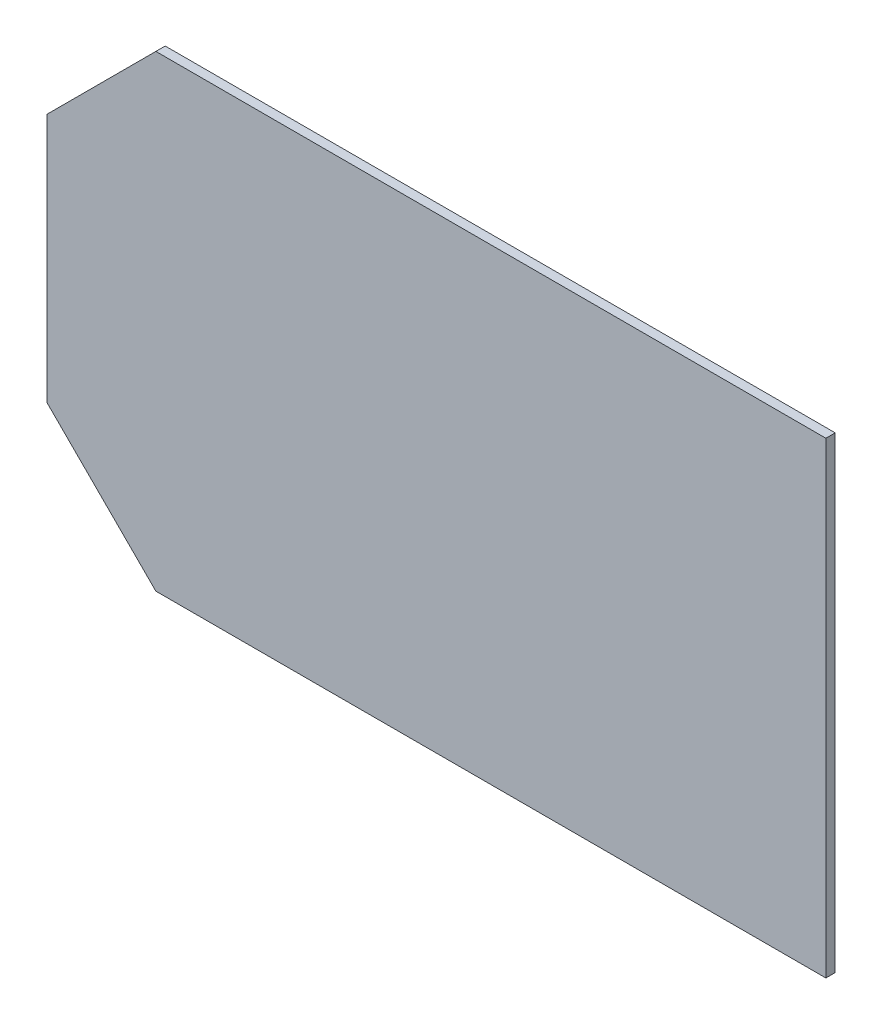
ISO-10303-21;
HEADER;
FILE_DESCRIPTION(('STEP AP214'),'2;1');
FILE_NAME('part.step','',(''),(''),'','','');
FILE_SCHEMA(('AUTOMOTIVE_DESIGN { 1 0 10303 214 1 1 1 1 }'));
ENDSEC;
DATA;
#1=APPLICATION_CONTEXT('core data for automotive mechanical design processes');
#2=APPLICATION_PROTOCOL_DEFINITION('international standard','automotive_design',2000,#1);
#3=PRODUCT_CONTEXT('',#1,'mechanical');
#4=PRODUCT('Part','Part','',(#3));
#5=PRODUCT_RELATED_PRODUCT_CATEGORY('part','',(#4));
#6=PRODUCT_DEFINITION_FORMATION('','',#4);
#7=PRODUCT_DEFINITION_CONTEXT('part definition',#1,'design');
#8=PRODUCT_DEFINITION('design','',#6,#7);
#9=PRODUCT_DEFINITION_SHAPE('','',#8);
#10=(LENGTH_UNIT() NAMED_UNIT(*) SI_UNIT(.MILLI.,.METRE.));
#11=(NAMED_UNIT(*) PLANE_ANGLE_UNIT() SI_UNIT($,.RADIAN.));
#12=(NAMED_UNIT(*) SI_UNIT($,.STERADIAN.) SOLID_ANGLE_UNIT());
#13=UNCERTAINTY_MEASURE_WITH_UNIT(LENGTH_MEASURE(1.E-05),#10,'distance_accuracy_value','');
#14=(GEOMETRIC_REPRESENTATION_CONTEXT(3) GLOBAL_UNCERTAINTY_ASSIGNED_CONTEXT((#13)) GLOBAL_UNIT_ASSIGNED_CONTEXT((#10,
#11,#12)) REPRESENTATION_CONTEXT('',''));
#15=CARTESIAN_POINT('',(0.,0.,0.));
#16=DIRECTION('',(0.,0.,1.));
#17=DIRECTION('',(1.,0.,0.));
#18=AXIS2_PLACEMENT_3D('',#15,#16,#17);
#19=CARTESIAN_POINT('',(125.,75.,3.));
#20=DIRECTION('',(-1.,0.,0.));
#21=DIRECTION('',(0.,-1.,0.));
#22=AXIS2_PLACEMENT_3D('',#19,#20,#21);
#23=PLANE('',#22);
#24=DIRECTION('',(0.,1.,0.));
#25=VECTOR('',#24,1.);
#26=CARTESIAN_POINT('',(125.,75.,0.));
#27=LINE('',#26,#25);
#28=CARTESIAN_POINT('',(125.,-75.,0.));
#29=VERTEX_POINT('',#28);
#30=CARTESIAN_POINT('',(125.,75.,0.));
#31=VERTEX_POINT('',#30);
#32=EDGE_CURVE('E122',#29,#31,#27,.T.);
#33=ORIENTED_EDGE('',*,*,#32,.T.);
#34=DIRECTION('',(0.,0.,-1.));
#35=VECTOR('',#34,1.);
#36=CARTESIAN_POINT('',(125.,75.,3.));
#37=LINE('',#36,#35);
#38=CARTESIAN_POINT('',(125.,75.,3.));
#39=VERTEX_POINT('',#38);
#40=EDGE_CURVE('E103',#39,#31,#37,.T.);
#41=ORIENTED_EDGE('',*,*,#40,.F.);
#42=DIRECTION('',(0.,1.,0.));
#43=VECTOR('',#42,1.);
#44=CARTESIAN_POINT('',(125.,75.,3.));
#45=LINE('',#44,#43);
#46=CARTESIAN_POINT('',(125.,-75.,3.));
#47=VERTEX_POINT('',#46);
#48=EDGE_CURVE('E109',#47,#39,#45,.T.);
#49=ORIENTED_EDGE('',*,*,#48,.F.);
#50=DIRECTION('',(0.,0.,-1.));
#51=VECTOR('',#50,1.);
#52=CARTESIAN_POINT('',(125.,-75.,3.));
#53=LINE('',#52,#51);
#54=EDGE_CURVE('E125',#47,#29,#53,.T.);
#55=ORIENTED_EDGE('',*,*,#54,.T.);
#56=EDGE_LOOP('',(#33,#41,#49,#55));
#57=FACE_BOUND('',#56,.T.);
#58=ADVANCED_FACE('F45',(#57),#23,.F.);
#59=CARTESIAN_POINT('',(-125.,75.,3.));
#60=DIRECTION('',(0.,-1.,0.));
#61=DIRECTION('',(0.,0.,-1.));
#62=AXIS2_PLACEMENT_3D('',#59,#60,#61);
#63=PLANE('',#62);
#64=DIRECTION('',(-1.,0.,0.));
#65=VECTOR('',#64,1.);
#66=CARTESIAN_POINT('',(-125.,75.,0.));
#67=LINE('',#66,#65);
#68=CARTESIAN_POINT('',(-89.9999999999999,75.,0.));
#69=VERTEX_POINT('',#68);
#70=EDGE_CURVE('E165',#31,#69,#67,.T.);
#71=ORIENTED_EDGE('',*,*,#70,.T.);
#72=DIRECTION('',(0.,0.,1.));
#73=VECTOR('',#72,1.);
#74=CARTESIAN_POINT('',(-89.9999999999999,75.,3.));
#75=LINE('',#74,#73);
#76=CARTESIAN_POINT('',(-89.9999999999999,75.,3.));
#77=VERTEX_POINT('',#76);
#78=EDGE_CURVE('E11',#69,#77,#75,.T.);
#79=ORIENTED_EDGE('',*,*,#78,.T.);
#80=DIRECTION('',(-1.,0.,0.));
#81=VECTOR('',#80,1.);
#82=CARTESIAN_POINT('',(-125.,75.,3.));
#83=LINE('',#82,#81);
#84=EDGE_CURVE('E99',#39,#77,#83,.T.);
#85=ORIENTED_EDGE('',*,*,#84,.F.);
#86=ORIENTED_EDGE('',*,*,#40,.T.);
#87=EDGE_LOOP('',(#71,#79,#85,#86));
#88=FACE_BOUND('',#87,.T.);
#89=ADVANCED_FACE('F101',(#88),#63,.F.);
#90=CARTESIAN_POINT('',(-125.,75.,3.));
#91=DIRECTION('',(1.,0.,0.));
#92=DIRECTION('',(0.,0.,-1.));
#93=AXIS2_PLACEMENT_3D('',#90,#91,#92);
#94=PLANE('',#93);
#95=DIRECTION('',(0.,-1.,0.));
#96=VECTOR('',#95,1.);
#97=CARTESIAN_POINT('',(-125.,75.,0.));
#98=LINE('',#97,#96);
#99=CARTESIAN_POINT('',(-125.,40.,0.));
#100=VERTEX_POINT('',#99);
#101=CARTESIAN_POINT('',(-125.,-39.9999999999998,0.));
#102=VERTEX_POINT('',#101);
#103=EDGE_CURVE('E161',#100,#102,#98,.T.);
#104=ORIENTED_EDGE('',*,*,#103,.T.);
#105=DIRECTION('',(0.,0.,1.));
#106=VECTOR('',#105,1.);
#107=CARTESIAN_POINT('',(-125.,-39.9999999999998,3.));
#108=LINE('',#107,#106);
#109=CARTESIAN_POINT('',(-125.,-39.9999999999998,3.));
#110=VERTEX_POINT('',#109);
#111=EDGE_CURVE('E68',#102,#110,#108,.T.);
#112=ORIENTED_EDGE('',*,*,#111,.T.);
#113=DIRECTION('',(0.,-1.,0.));
#114=VECTOR('',#113,1.);
#115=CARTESIAN_POINT('',(-125.,75.,3.));
#116=LINE('',#115,#114);
#117=CARTESIAN_POINT('',(-125.,40.,3.));
#118=VERTEX_POINT('',#117);
#119=EDGE_CURVE('E108',#118,#110,#116,.T.);
#120=ORIENTED_EDGE('',*,*,#119,.F.);
#121=DIRECTION('',(0.,0.,-1.));
#122=VECTOR('',#121,1.);
#123=CARTESIAN_POINT('',(-125.,40.,3.));
#124=LINE('',#123,#122);
#125=EDGE_CURVE('E140',#118,#100,#124,.T.);
#126=ORIENTED_EDGE('',*,*,#125,.T.);
#127=EDGE_LOOP('',(#104,#112,#120,#126));
#128=FACE_BOUND('',#127,.T.);
#129=ADVANCED_FACE('F162',(#128),#94,.F.);
#130=CARTESIAN_POINT('',(-125.,-75.,3.));
#131=DIRECTION('',(0.,1.,0.));
#132=DIRECTION('',(0.,0.,1.));
#133=AXIS2_PLACEMENT_3D('',#130,#131,#132);
#134=PLANE('',#133);
#135=DIRECTION('',(1.,0.,0.));
#136=VECTOR('',#135,1.);
#137=CARTESIAN_POINT('',(-125.,-75.,3.));
#138=LINE('',#137,#136);
#139=CARTESIAN_POINT('',(-90.,-75.,3.));
#140=VERTEX_POINT('',#139);
#141=EDGE_CURVE('E114',#140,#47,#138,.T.);
#142=ORIENTED_EDGE('',*,*,#141,.F.);
#143=DIRECTION('',(0.,0.,-1.));
#144=VECTOR('',#143,1.);
#145=CARTESIAN_POINT('',(-90.,-75.,3.));
#146=LINE('',#145,#144);
#147=CARTESIAN_POINT('',(-90.,-75.,0.));
#148=VERTEX_POINT('',#147);
#149=EDGE_CURVE('E124',#140,#148,#146,.T.);
#150=ORIENTED_EDGE('',*,*,#149,.T.);
#151=DIRECTION('',(1.,0.,0.));
#152=VECTOR('',#151,1.);
#153=CARTESIAN_POINT('',(-125.,-75.,0.));
#154=LINE('',#153,#152);
#155=EDGE_CURVE('E119',#148,#29,#154,.T.);
#156=ORIENTED_EDGE('',*,*,#155,.T.);
#157=ORIENTED_EDGE('',*,*,#54,.F.);
#158=EDGE_LOOP('',(#142,#150,#156,#157));
#159=FACE_BOUND('',#158,.T.);
#160=ADVANCED_FACE('F153',(#159),#134,.F.);
#161=CARTESIAN_POINT('',(0.,0.,3.));
#162=DIRECTION('',(0.,0.,1.));
#163=DIRECTION('',(1.,0.,0.));
#164=AXIS2_PLACEMENT_3D('',#161,#162,#163);
#165=PLANE('',#164);
#166=ORIENTED_EDGE('',*,*,#119,.T.);
#167=DIRECTION('',(-0.707106781186546,0.707106781186549,0.));
#168=VECTOR('',#167,1.);
#169=CARTESIAN_POINT('',(-82.5000000000002,-82.4999999999998,3.));
#170=LINE('',#169,#168);
#171=EDGE_CURVE('E55',#110,#140,#170,.F.);
#172=ORIENTED_EDGE('',*,*,#171,.T.);
#173=ORIENTED_EDGE('',*,*,#141,.T.);
#174=ORIENTED_EDGE('',*,*,#48,.T.);
#175=ORIENTED_EDGE('',*,*,#84,.T.);
#176=DIRECTION('',(0.707106781186549,0.707106781186546,0.));
#177=VECTOR('',#176,1.);
#178=CARTESIAN_POINT('',(-82.4999999999998,82.5000000000001,3.));
#179=LINE('',#178,#177);
#180=EDGE_CURVE('E146',#77,#118,#179,.F.);
#181=ORIENTED_EDGE('',*,*,#180,.T.);
#182=EDGE_LOOP('',(#166,#172,#173,#174,#175,#181));
#183=FACE_BOUND('',#182,.T.);
#184=ADVANCED_FACE('F112',(#183),#165,.T.);
#185=CARTESIAN_POINT('',(0.,0.,0.));
#186=DIRECTION('',(0.,0.,1.));
#187=DIRECTION('',(1.,0.,0.));
#188=AXIS2_PLACEMENT_3D('',#185,#186,#187);
#189=PLANE('',#188);
#190=ORIENTED_EDGE('',*,*,#155,.F.);
#191=DIRECTION('',(0.707106781186546,-0.707106781186549,0.));
#192=VECTOR('',#191,1.);
#193=CARTESIAN_POINT('',(-90.,-75.,0.));
#194=LINE('',#193,#192);
#195=EDGE_CURVE('E137',#148,#102,#194,.F.);
#196=ORIENTED_EDGE('',*,*,#195,.T.);
#197=ORIENTED_EDGE('',*,*,#103,.F.);
#198=DIRECTION('',(-0.707106781186549,-0.707106781186546,0.));
#199=VECTOR('',#198,1.);
#200=CARTESIAN_POINT('',(-125.,40.,0.));
#201=LINE('',#200,#199);
#202=EDGE_CURVE('E130',#100,#69,#201,.F.);
#203=ORIENTED_EDGE('',*,*,#202,.T.);
#204=ORIENTED_EDGE('',*,*,#70,.F.);
#205=ORIENTED_EDGE('',*,*,#32,.F.);
#206=EDGE_LOOP('',(#190,#196,#197,#203,#204,#205));
#207=FACE_BOUND('',#206,.T.);
#208=ADVANCED_FACE('F160',(#207),#189,.F.);
#209=CARTESIAN_POINT('',(-90.,-75.,3.));
#210=DIRECTION('',(0.707106781186549,0.707106781186546,0.));
#211=DIRECTION('',(0.,0.,-1.));
#212=AXIS2_PLACEMENT_3D('',#209,#210,#211);
#213=PLANE('',#212);
#214=ORIENTED_EDGE('',*,*,#171,.F.);
#215=ORIENTED_EDGE('',*,*,#111,.F.);
#216=ORIENTED_EDGE('',*,*,#195,.F.);
#217=ORIENTED_EDGE('',*,*,#149,.F.);
#218=EDGE_LOOP('',(#214,#215,#216,#217));
#219=FACE_BOUND('',#218,.T.);
#220=ADVANCED_FACE('F157',(#219),#213,.F.);
#221=CARTESIAN_POINT('',(-125.,40.,3.));
#222=DIRECTION('',(0.707106781186546,-0.707106781186549,0.));
#223=DIRECTION('',(0.,0.,-1.));
#224=AXIS2_PLACEMENT_3D('',#221,#222,#223);
#225=PLANE('',#224);
#226=ORIENTED_EDGE('',*,*,#180,.F.);
#227=ORIENTED_EDGE('',*,*,#78,.F.);
#228=ORIENTED_EDGE('',*,*,#202,.F.);
#229=ORIENTED_EDGE('',*,*,#125,.F.);
#230=EDGE_LOOP('',(#226,#227,#228,#229));
#231=FACE_BOUND('',#230,.T.);
#232=ADVANCED_FACE('F48',(#231),#225,.F.);
#233=CLOSED_SHELL('',(#58,#89,#129,#160,#184,#208,#220,#232));
#234=MANIFOLD_SOLID_BREP('B2',#233);
#235=ADVANCED_BREP_SHAPE_REPRESENTATION('',(#18,#234),#14);
#236=SHAPE_DEFINITION_REPRESENTATION(#9,#235);
ENDSEC;
END-ISO-10303-21;
